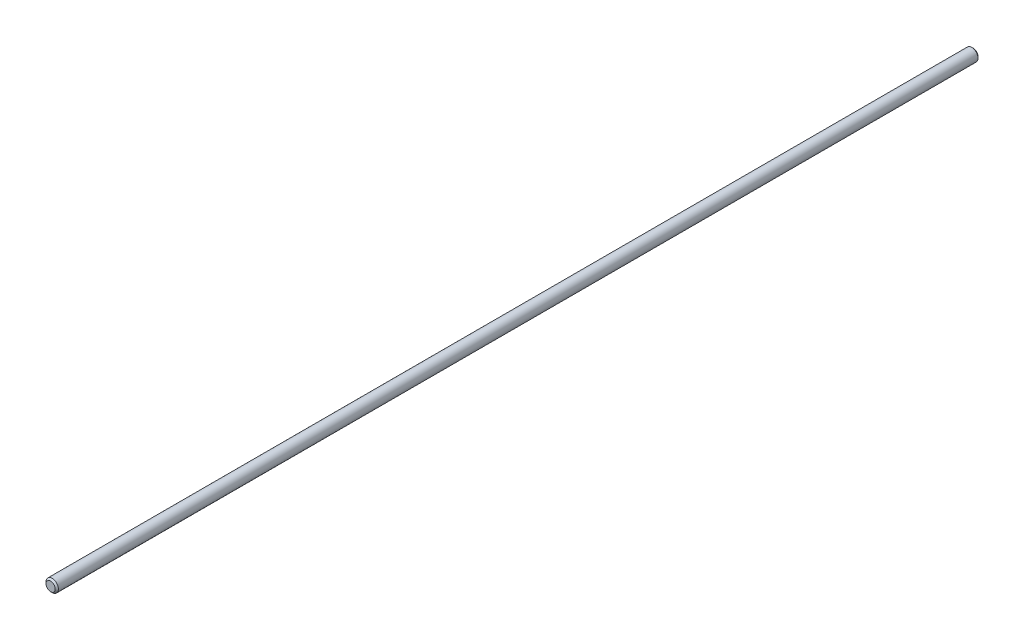
ISO-10303-21;
HEADER;
FILE_DESCRIPTION(('STEP AP214'),'2;1');
FILE_NAME('part.step','',(''),(''),'','','');
FILE_SCHEMA(('AUTOMOTIVE_DESIGN { 1 0 10303 214 1 1 1 1 }'));
ENDSEC;
DATA;
#1=APPLICATION_CONTEXT('core data for automotive mechanical design processes');
#2=APPLICATION_PROTOCOL_DEFINITION('international standard','automotive_design',2000,#1);
#3=PRODUCT_CONTEXT('',#1,'mechanical');
#4=PRODUCT('Part','Part','',(#3));
#5=PRODUCT_RELATED_PRODUCT_CATEGORY('part','',(#4));
#6=PRODUCT_DEFINITION_FORMATION('','',#4);
#7=PRODUCT_DEFINITION_CONTEXT('part definition',#1,'design');
#8=PRODUCT_DEFINITION('design','',#6,#7);
#9=PRODUCT_DEFINITION_SHAPE('','',#8);
#10=(LENGTH_UNIT() NAMED_UNIT(*) SI_UNIT(.MILLI.,.METRE.));
#11=(NAMED_UNIT(*) PLANE_ANGLE_UNIT() SI_UNIT($,.RADIAN.));
#12=(NAMED_UNIT(*) SI_UNIT($,.STERADIAN.) SOLID_ANGLE_UNIT());
#13=UNCERTAINTY_MEASURE_WITH_UNIT(LENGTH_MEASURE(1.E-05),#10,'distance_accuracy_value','');
#14=(GEOMETRIC_REPRESENTATION_CONTEXT(3) GLOBAL_UNCERTAINTY_ASSIGNED_CONTEXT((#13)) GLOBAL_UNIT_ASSIGNED_CONTEXT((#10,
#11,#12)) REPRESENTATION_CONTEXT('',''));
#15=CARTESIAN_POINT('',(0.,0.,0.));
#16=DIRECTION('',(0.,0.,1.));
#17=DIRECTION('',(1.,0.,0.));
#18=AXIS2_PLACEMENT_3D('',#15,#16,#17);
#19=CARTESIAN_POINT('',(0.,0.,298.45));
#20=DIRECTION('',(0.,0.,-1.));
#21=DIRECTION('',(-1.,0.,0.));
#22=AXIS2_PLACEMENT_3D('',#19,#20,#21);
#23=CYLINDRICAL_SURFACE('',#22,2.);
#24=CARTESIAN_POINT('',(0.,0.,0.508000000000119));
#25=DIRECTION('',(0.,0.,1.));
#26=DIRECTION('',(1.,0.,0.));
#27=AXIS2_PLACEMENT_3D('',#24,#25,#26);
#28=CIRCLE('',#27,2.);
#29=CARTESIAN_POINT('',(2.,0.,0.508000000000119));
#30=VERTEX_POINT('',#29);
#31=EDGE_CURVE('E41',#30,#30,#28,.T.);
#32=ORIENTED_EDGE('',*,*,#31,.T.);
#33=EDGE_LOOP('',(#32));
#34=FACE_BOUND('',#33,.T.);
#35=CARTESIAN_POINT('',(0.,0.,297.942));
#36=DIRECTION('',(0.,0.,1.));
#37=DIRECTION('',(1.,0.,0.));
#38=AXIS2_PLACEMENT_3D('',#35,#36,#37);
#39=CIRCLE('',#38,2.);
#40=CARTESIAN_POINT('',(2.,0.,297.942));
#41=VERTEX_POINT('',#40);
#42=EDGE_CURVE('E45',#41,#41,#39,.F.);
#43=ORIENTED_EDGE('',*,*,#42,.T.);
#44=EDGE_LOOP('',(#43));
#45=FACE_BOUND('',#44,.T.);
#46=ADVANCED_FACE('F30',(#34,#45),#23,.T.);
#47=CARTESIAN_POINT('',(0.,0.,298.45));
#48=DIRECTION('',(0.,0.,1.));
#49=DIRECTION('',(1.,0.,0.));
#50=AXIS2_PLACEMENT_3D('',#47,#48,#49);
#51=PLANE('',#50);
#52=CARTESIAN_POINT('',(0.,0.,298.45));
#53=DIRECTION('',(0.,0.,1.));
#54=DIRECTION('',(1.,0.,0.));
#55=AXIS2_PLACEMENT_3D('',#52,#53,#54);
#56=CIRCLE('',#55,1.49199999999999);
#57=CARTESIAN_POINT('',(1.49199999999999,0.,298.45));
#58=VERTEX_POINT('',#57);
#59=EDGE_CURVE('E10',#58,#58,#56,.T.);
#60=ORIENTED_EDGE('',*,*,#59,.T.);
#61=EDGE_LOOP('',(#60));
#62=FACE_BOUND('',#61,.T.);
#63=ADVANCED_FACE('F61',(#62),#51,.T.);
#64=CARTESIAN_POINT('',(0.,0.,0.));
#65=DIRECTION('',(0.,0.,1.));
#66=DIRECTION('',(1.,0.,0.));
#67=AXIS2_PLACEMENT_3D('',#64,#65,#66);
#68=PLANE('',#67);
#69=CARTESIAN_POINT('',(0.,0.,0.));
#70=DIRECTION('',(0.,0.,1.));
#71=DIRECTION('',(1.,0.,0.));
#72=AXIS2_PLACEMENT_3D('',#69,#70,#71);
#73=CIRCLE('',#72,1.49199999999988);
#74=CARTESIAN_POINT('',(1.49199999999988,0.,0.));
#75=VERTEX_POINT('',#74);
#76=EDGE_CURVE('E37',#75,#75,#73,.F.);
#77=ORIENTED_EDGE('',*,*,#76,.T.);
#78=EDGE_LOOP('',(#77));
#79=FACE_BOUND('',#78,.T.);
#80=ADVANCED_FACE('F58',(#79),#68,.F.);
#81=CARTESIAN_POINT('',(0.,0.,0.508000000000119));
#82=DIRECTION('',(0.,0.,1.));
#83=DIRECTION('',(1.,0.,0.));
#84=AXIS2_PLACEMENT_3D('',#81,#82,#83);
#85=CONICAL_SURFACE('',#84,2.,0.785398163397446);
#86=ORIENTED_EDGE('',*,*,#76,.F.);
#87=EDGE_LOOP('',(#86));
#88=FACE_BOUND('',#87,.T.);
#89=ORIENTED_EDGE('',*,*,#31,.F.);
#90=EDGE_LOOP('',(#89));
#91=FACE_BOUND('',#90,.T.);
#92=ADVANCED_FACE('F54',(#88,#91),#85,.T.);
#93=CARTESIAN_POINT('',(0.,0.,298.45));
#94=DIRECTION('',(0.,0.,-1.));
#95=DIRECTION('',(-1.,0.,0.));
#96=AXIS2_PLACEMENT_3D('',#93,#94,#95);
#97=CONICAL_SURFACE('',#96,1.49199999999999,0.785398163397446);
#98=ORIENTED_EDGE('',*,*,#42,.F.);
#99=EDGE_LOOP('',(#98));
#100=FACE_BOUND('',#99,.T.);
#101=ORIENTED_EDGE('',*,*,#59,.F.);
#102=EDGE_LOOP('',(#101));
#103=FACE_BOUND('',#102,.T.);
#104=ADVANCED_FACE('F32',(#100,#103),#97,.T.);
#105=CLOSED_SHELL('',(#46,#63,#80,#92,#104));
#106=MANIFOLD_SOLID_BREP('B2',#105);
#107=ADVANCED_BREP_SHAPE_REPRESENTATION('',(#18,#106),#14);
#108=SHAPE_DEFINITION_REPRESENTATION(#9,#107);
ENDSEC;
END-ISO-10303-21;
